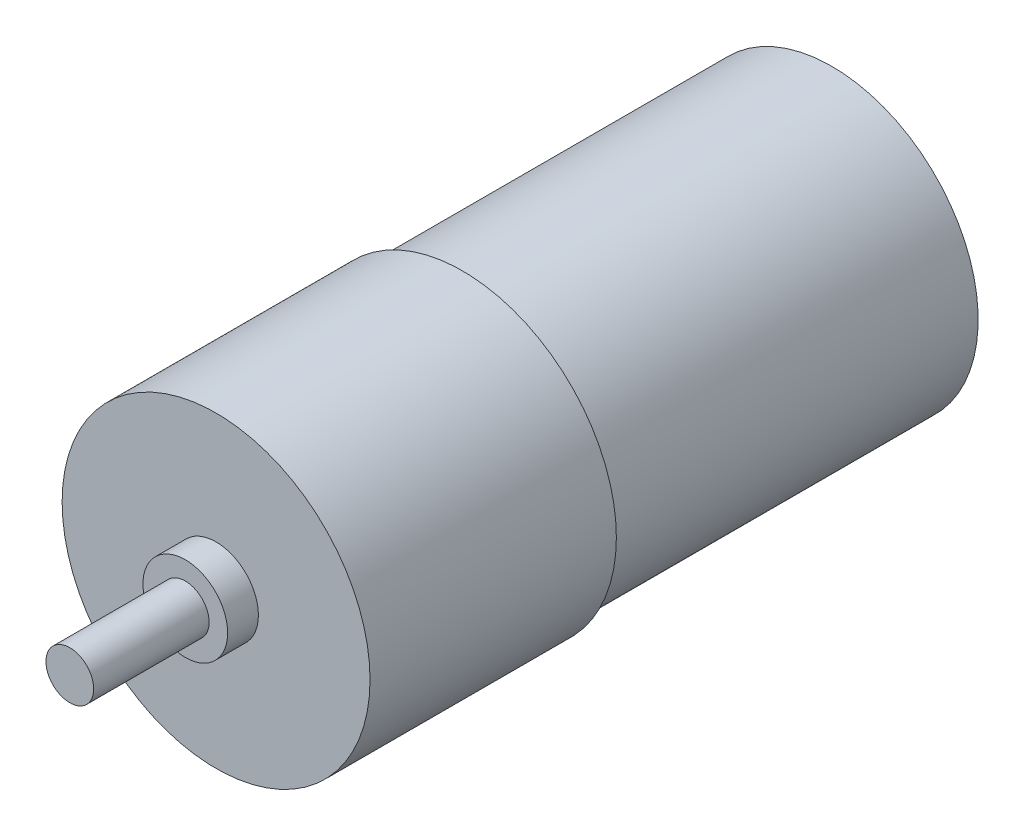
ISO-10303-21;
HEADER;
FILE_DESCRIPTION(('STEP AP214'),'2;1');
FILE_NAME('part.step','',(''),(''),'','','');
FILE_SCHEMA(('AUTOMOTIVE_DESIGN { 1 0 10303 214 1 1 1 1 }'));
ENDSEC;
DATA;
#1=APPLICATION_CONTEXT('core data for automotive mechanical design processes');
#2=APPLICATION_PROTOCOL_DEFINITION('international standard','automotive_design',2000,#1);
#3=PRODUCT_CONTEXT('',#1,'mechanical');
#4=PRODUCT('Part','Part','',(#3));
#5=PRODUCT_RELATED_PRODUCT_CATEGORY('part','',(#4));
#6=PRODUCT_DEFINITION_FORMATION('','',#4);
#7=PRODUCT_DEFINITION_CONTEXT('part definition',#1,'design');
#8=PRODUCT_DEFINITION('design','',#6,#7);
#9=PRODUCT_DEFINITION_SHAPE('','',#8);
#10=(LENGTH_UNIT() NAMED_UNIT(*) SI_UNIT(.MILLI.,.METRE.));
#11=(NAMED_UNIT(*) PLANE_ANGLE_UNIT() SI_UNIT($,.RADIAN.));
#12=(NAMED_UNIT(*) SI_UNIT($,.STERADIAN.) SOLID_ANGLE_UNIT());
#13=UNCERTAINTY_MEASURE_WITH_UNIT(LENGTH_MEASURE(1.E-05),#10,'distance_accuracy_value','');
#14=(GEOMETRIC_REPRESENTATION_CONTEXT(3) GLOBAL_UNCERTAINTY_ASSIGNED_CONTEXT((#13)) GLOBAL_UNIT_ASSIGNED_CONTEXT((#10,
#11,#12)) REPRESENTATION_CONTEXT('',''));
#15=CARTESIAN_POINT('',(0.,0.,0.));
#16=DIRECTION('',(0.,0.,1.));
#17=DIRECTION('',(1.,0.,0.));
#18=AXIS2_PLACEMENT_3D('',#15,#16,#17);
#19=CARTESIAN_POINT('',(0.,0.,50.8));
#20=DIRECTION('',(0.,0.,-1.));
#21=DIRECTION('',(-1.,0.,0.));
#22=AXIS2_PLACEMENT_3D('',#19,#20,#21);
#23=CYLINDRICAL_SURFACE('',#22,12.7);
#24=CARTESIAN_POINT('',(0.,0.,50.8));
#25=DIRECTION('',(0.,0.,1.));
#26=DIRECTION('',(1.,0.,0.));
#27=AXIS2_PLACEMENT_3D('',#24,#25,#26);
#28=CIRCLE('',#27,12.7);
#29=CARTESIAN_POINT('',(12.7,0.,50.8));
#30=VERTEX_POINT('',#29);
#31=EDGE_CURVE('E11',#30,#30,#28,.T.);
#32=ORIENTED_EDGE('',*,*,#31,.F.);
#33=EDGE_LOOP('',(#32));
#34=FACE_BOUND('',#33,.T.);
#35=CARTESIAN_POINT('',(0.,0.,30.48));
#36=DIRECTION('',(0.,0.,-1.));
#37=DIRECTION('',(-1.,0.,0.));
#38=AXIS2_PLACEMENT_3D('',#35,#36,#37);
#39=CIRCLE('',#38,12.7);
#40=CARTESIAN_POINT('',(-12.7,0.,30.48));
#41=VERTEX_POINT('',#40);
#42=EDGE_CURVE('E37',#41,#41,#39,.T.);
#43=ORIENTED_EDGE('',*,*,#42,.F.);
#44=EDGE_LOOP('',(#43));
#45=FACE_BOUND('',#44,.T.);
#46=ADVANCED_FACE('F34',(#34,#45),#23,.T.);
#47=CARTESIAN_POINT('',(0.,0.,53.34));
#48=DIRECTION('',(0.,0.,1.));
#49=DIRECTION('',(1.,0.,0.));
#50=AXIS2_PLACEMENT_3D('',#47,#48,#49);
#51=PLANE('',#50);
#52=CARTESIAN_POINT('',(0.,0.,53.34));
#53=DIRECTION('',(0.,0.,1.));
#54=DIRECTION('',(1.,0.,0.));
#55=AXIS2_PLACEMENT_3D('',#52,#53,#54);
#56=CIRCLE('',#55,3.4925);
#57=CARTESIAN_POINT('',(3.4925,0.,53.34));
#58=VERTEX_POINT('',#57);
#59=EDGE_CURVE('E41',#58,#58,#56,.T.);
#60=ORIENTED_EDGE('',*,*,#59,.T.);
#61=EDGE_LOOP('',(#60));
#62=FACE_BOUND('',#61,.T.);
#63=CARTESIAN_POINT('',(0.,0.,53.34));
#64=DIRECTION('',(0.,0.,1.));
#65=DIRECTION('',(1.,0.,0.));
#66=AXIS2_PLACEMENT_3D('',#63,#64,#65);
#67=CIRCLE('',#66,1.9685);
#68=CARTESIAN_POINT('',(1.9685,0.,53.34));
#69=VERTEX_POINT('',#68);
#70=EDGE_CURVE('E51',#69,#69,#67,.T.);
#71=ORIENTED_EDGE('',*,*,#70,.F.);
#72=EDGE_LOOP('',(#71));
#73=FACE_BOUND('',#72,.T.);
#74=ADVANCED_FACE('F69',(#62,#73),#51,.T.);
#75=CARTESIAN_POINT('',(0.,0.,50.8));
#76=DIRECTION('',(0.,0.,1.));
#77=DIRECTION('',(1.,0.,0.));
#78=AXIS2_PLACEMENT_3D('',#75,#76,#77);
#79=PLANE('',#78);
#80=ORIENTED_EDGE('',*,*,#31,.T.);
#81=EDGE_LOOP('',(#80));
#82=FACE_BOUND('',#81,.T.);
#83=CARTESIAN_POINT('',(0.,0.,50.8));
#84=DIRECTION('',(0.,0.,1.));
#85=DIRECTION('',(1.,0.,0.));
#86=AXIS2_PLACEMENT_3D('',#83,#84,#85);
#87=CIRCLE('',#86,3.4925);
#88=CARTESIAN_POINT('',(3.4925,0.,50.8));
#89=VERTEX_POINT('',#88);
#90=EDGE_CURVE('E45',#89,#89,#87,.T.);
#91=ORIENTED_EDGE('',*,*,#90,.F.);
#92=EDGE_LOOP('',(#91));
#93=FACE_BOUND('',#92,.T.);
#94=ADVANCED_FACE('F74',(#82,#93),#79,.T.);
#95=CARTESIAN_POINT('',(0.,0.,53.34));
#96=DIRECTION('',(0.,0.,-1.));
#97=DIRECTION('',(-1.,0.,0.));
#98=AXIS2_PLACEMENT_3D('',#95,#96,#97);
#99=CYLINDRICAL_SURFACE('',#98,3.4925);
#100=ORIENTED_EDGE('',*,*,#59,.F.);
#101=EDGE_LOOP('',(#100));
#102=FACE_BOUND('',#101,.T.);
#103=ORIENTED_EDGE('',*,*,#90,.T.);
#104=EDGE_LOOP('',(#103));
#105=FACE_BOUND('',#104,.T.);
#106=ADVANCED_FACE('F80',(#102,#105),#99,.T.);
#107=CARTESIAN_POINT('',(0.,0.,62.865));
#108=DIRECTION('',(0.,0.,-1.));
#109=DIRECTION('',(-1.,0.,0.));
#110=AXIS2_PLACEMENT_3D('',#107,#108,#109);
#111=CYLINDRICAL_SURFACE('',#110,1.9685);
#112=CARTESIAN_POINT('',(0.,0.,62.865));
#113=DIRECTION('',(0.,0.,1.));
#114=DIRECTION('',(1.,0.,0.));
#115=AXIS2_PLACEMENT_3D('',#112,#113,#114);
#116=CIRCLE('',#115,1.9685);
#117=CARTESIAN_POINT('',(1.9685,0.,62.865));
#118=VERTEX_POINT('',#117);
#119=EDGE_CURVE('E49',#118,#118,#116,.T.);
#120=ORIENTED_EDGE('',*,*,#119,.F.);
#121=EDGE_LOOP('',(#120));
#122=FACE_BOUND('',#121,.T.);
#123=ORIENTED_EDGE('',*,*,#70,.T.);
#124=EDGE_LOOP('',(#123));
#125=FACE_BOUND('',#124,.T.);
#126=ADVANCED_FACE('F85',(#122,#125),#111,.T.);
#127=CARTESIAN_POINT('',(0.,0.,62.865));
#128=DIRECTION('',(0.,0.,1.));
#129=DIRECTION('',(1.,0.,0.));
#130=AXIS2_PLACEMENT_3D('',#127,#128,#129);
#131=PLANE('',#130);
#132=ORIENTED_EDGE('',*,*,#119,.T.);
#133=EDGE_LOOP('',(#132));
#134=FACE_BOUND('',#133,.T.);
#135=ADVANCED_FACE('F102',(#134),#131,.T.);
#136=CARTESIAN_POINT('',(0.,0.,30.48));
#137=DIRECTION('',(0.,0.,-1.));
#138=DIRECTION('',(-1.,0.,0.));
#139=AXIS2_PLACEMENT_3D('',#136,#137,#138);
#140=PLANE('',#139);
#141=CARTESIAN_POINT('',(0.,0.,30.48));
#142=DIRECTION('',(0.,0.,-1.));
#143=DIRECTION('',(-1.,0.,0.));
#144=AXIS2_PLACEMENT_3D('',#141,#142,#143);
#145=CIRCLE('',#144,12.065);
#146=CARTESIAN_POINT('',(-12.065,0.,30.48));
#147=VERTEX_POINT('',#146);
#148=EDGE_CURVE('E59',#147,#147,#145,.T.);
#149=ORIENTED_EDGE('',*,*,#148,.F.);
#150=EDGE_LOOP('',(#149));
#151=FACE_BOUND('',#150,.T.);
#152=ORIENTED_EDGE('',*,*,#42,.T.);
#153=EDGE_LOOP('',(#152));
#154=FACE_BOUND('',#153,.T.);
#155=ADVANCED_FACE('F66',(#151,#154),#140,.T.);
#156=CARTESIAN_POINT('',(0.,0.,30.48));
#157=DIRECTION('',(0.,0.,-1.));
#158=DIRECTION('',(-1.,0.,0.));
#159=AXIS2_PLACEMENT_3D('',#156,#157,#158);
#160=CYLINDRICAL_SURFACE('',#159,12.065);
#161=ORIENTED_EDGE('',*,*,#148,.T.);
#162=EDGE_LOOP('',(#161));
#163=FACE_BOUND('',#162,.T.);
#164=CARTESIAN_POINT('',(0.,0.,0.));
#165=DIRECTION('',(0.,0.,-1.));
#166=DIRECTION('',(-1.,0.,0.));
#167=AXIS2_PLACEMENT_3D('',#164,#165,#166);
#168=CIRCLE('',#167,12.065);
#169=CARTESIAN_POINT('',(-12.065,0.,0.));
#170=VERTEX_POINT('',#169);
#171=EDGE_CURVE('E56',#170,#170,#168,.T.);
#172=ORIENTED_EDGE('',*,*,#171,.F.);
#173=EDGE_LOOP('',(#172));
#174=FACE_BOUND('',#173,.T.);
#175=ADVANCED_FACE('F91',(#163,#174),#160,.T.);
#176=CARTESIAN_POINT('',(0.,0.,0.));
#177=DIRECTION('',(0.,0.,1.));
#178=DIRECTION('',(1.,0.,0.));
#179=AXIS2_PLACEMENT_3D('',#176,#177,#178);
#180=PLANE('',#179);
#181=ORIENTED_EDGE('',*,*,#171,.T.);
#182=EDGE_LOOP('',(#181));
#183=FACE_BOUND('',#182,.T.);
#184=ADVANCED_FACE('F89',(#183),#180,.F.);
#185=CLOSED_SHELL('',(#46,#74,#94,#106,#126,#135,#155,#175,#184));
#186=MANIFOLD_SOLID_BREP('B2',#185);
#187=ADVANCED_BREP_SHAPE_REPRESENTATION('',(#18,#186),#14);
#188=SHAPE_DEFINITION_REPRESENTATION(#9,#187);
ENDSEC;
END-ISO-10303-21;
